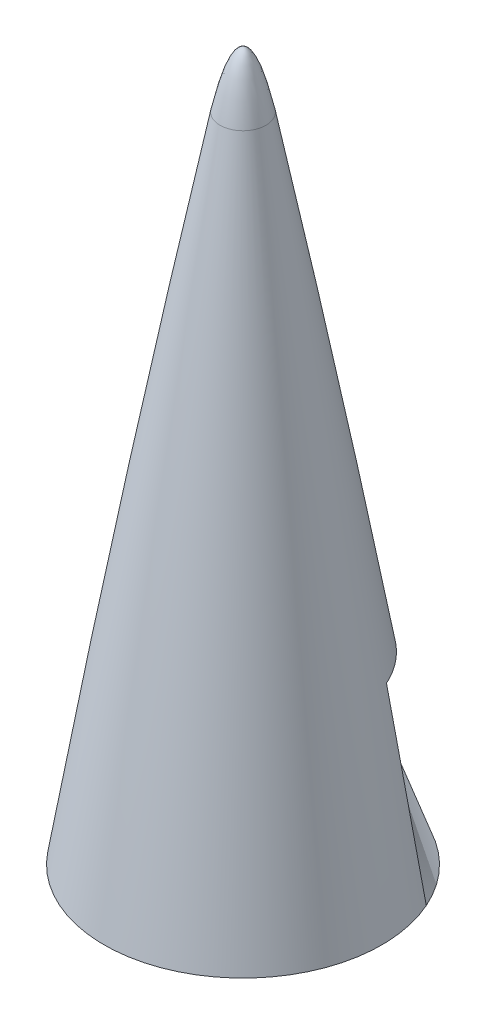
ISO-10303-21;
HEADER;
FILE_DESCRIPTION(('STEP AP214'),'2;1');
FILE_NAME('part.step','',(''),(''),'','','');
FILE_SCHEMA(('AUTOMOTIVE_DESIGN { 1 0 10303 214 1 1 1 1 }'));
ENDSEC;
DATA;
#1=APPLICATION_CONTEXT('core data for automotive mechanical design processes');
#2=APPLICATION_PROTOCOL_DEFINITION('international standard','automotive_design',2000,#1);
#3=PRODUCT_CONTEXT('',#1,'mechanical');
#4=PRODUCT('Part','Part','',(#3));
#5=PRODUCT_RELATED_PRODUCT_CATEGORY('part','',(#4));
#6=PRODUCT_DEFINITION_FORMATION('','',#4);
#7=PRODUCT_DEFINITION_CONTEXT('part definition',#1,'design');
#8=PRODUCT_DEFINITION('design','',#6,#7);
#9=PRODUCT_DEFINITION_SHAPE('','',#8);
#10=(LENGTH_UNIT() NAMED_UNIT(*) SI_UNIT(.MILLI.,.METRE.));
#11=(NAMED_UNIT(*) PLANE_ANGLE_UNIT() SI_UNIT($,.RADIAN.));
#12=(NAMED_UNIT(*) SI_UNIT($,.STERADIAN.) SOLID_ANGLE_UNIT());
#13=UNCERTAINTY_MEASURE_WITH_UNIT(LENGTH_MEASURE(1.E-05),#10,'distance_accuracy_value','');
#14=(GEOMETRIC_REPRESENTATION_CONTEXT(3) GLOBAL_UNCERTAINTY_ASSIGNED_CONTEXT((#13)) GLOBAL_UNIT_ASSIGNED_CONTEXT((#10,
#11,#12)) REPRESENTATION_CONTEXT('',''));
#15=CARTESIAN_POINT('',(0.,0.,0.));
#16=DIRECTION('',(0.,0.,1.));
#17=DIRECTION('',(1.,0.,0.));
#18=AXIS2_PLACEMENT_3D('',#15,#16,#17);
#19=CARTESIAN_POINT('',(-3.5527136788005E-12,1.80102599500742E-08,0.));
#20=DIRECTION('',(0.,1.,0.));
#21=DIRECTION('',(-1.,0.,0.));
#22=AXIS2_PLACEMENT_3D('',#19,#20,#21);
#23=DEGENERATE_TOROIDAL_SURFACE('',#22,5029.19999990055,5130.79999989884,.F.);
#24=CARTESIAN_POINT('',(0.,812.800000000069,0.));
#25=DIRECTION('',(0.,1.,0.));
#26=DIRECTION('',(-1.,0.,0.));
#27=AXIS2_PLACEMENT_3D('',#24,#25,#26);
#28=CIRCLE('',#27,36.8107382434125);
#29=CARTESIAN_POINT('',(-36.8107382434125,812.80000000007,0.));
#30=VERTEX_POINT('',#29);
#31=EDGE_CURVE('E11',#30,#30,#28,.T.);
#32=ORIENTED_EDGE('',*,*,#31,.T.);
#33=EDGE_LOOP('',(#32));
#34=FACE_BOUND('',#33,.T.);
#35=CARTESIAN_POINT('',(0.,985.4578151198,0.));
#36=DIRECTION('',(0.,-1.,0.));
#37=DIRECTION('',(0.,0.,-1.));
#38=AXIS2_PLACEMENT_3D('',#35,#36,#37);
#39=CIRCLE('',#38,6.07372985997312);
#40=CARTESIAN_POINT('',(0.,985.4578151198,-6.07372985997312));
#41=VERTEX_POINT('',#40);
#42=EDGE_CURVE('E41',#41,#41,#39,.T.);
#43=ORIENTED_EDGE('',*,*,#42,.T.);
#44=EDGE_LOOP('',(#43));
#45=FACE_BOUND('',#44,.T.);
#46=ADVANCED_FACE('F35',(#34,#45),#23,.F.);
#47=CARTESIAN_POINT('',(0.,812.800000000035,0.));
#48=DIRECTION('',(0.,-1.,0.));
#49=DIRECTION('',(1.,0.,0.));
#50=AXIS2_PLACEMENT_3D('',#47,#48,#49);
#51=PLANE('',#50);
#52=ORIENTED_EDGE('',*,*,#31,.F.);
#53=EDGE_LOOP('',(#52));
#54=FACE_BOUND('',#53,.T.);
#55=ADVANCED_FACE('F47',(#54),#51,.T.);
#56=CARTESIAN_POINT('',(0.,985.4578151198,-6.07372985997312));
#57=CARTESIAN_POINT('',(0.,1000.33869195154,-3.0131966552106));
#58=CARTESIAN_POINT('',(0.,1000.3224787326,0.));
#59=B_SPLINE_CURVE_WITH_KNOTS('',2,(#56,#57,#58),.UNSPECIFIED.,.F.,.F.,(3,3),(0.,
0.500461160030229),.UNSPECIFIED.);
#60=CARTESIAN_POINT('',(0.,985.4578151198,0.));
#61=DIRECTION('',(0.,-1.,0.));
#62=AXIS1_PLACEMENT('',#60,#61);
#63=SURFACE_OF_REVOLUTION('',#59,#62);
#64=CARTESIAN_POINT('',(0.,1000.3224787326,0.));
#65=VERTEX_POINT('',#64);
#66=VERTEX_LOOP('',#65);
#67=FACE_BOUND('',#66,.T.);
#68=ORIENTED_EDGE('',*,*,#42,.F.);
#69=EDGE_LOOP('',(#68));
#70=FACE_BOUND('',#69,.T.);
#71=ADVANCED_FACE('F44',(#67,#70),#63,.F.);
#72=CLOSED_SHELL('',(#46,#55,#71));
#73=MANIFOLD_SOLID_BREP('B2',#72);
#74=ADVANCED_BREP_SHAPE_REPRESENTATION('',(#18,#73),#14);
#75=SHAPE_DEFINITION_REPRESENTATION(#9,#74);
ENDSEC;
END-ISO-10303-21;
